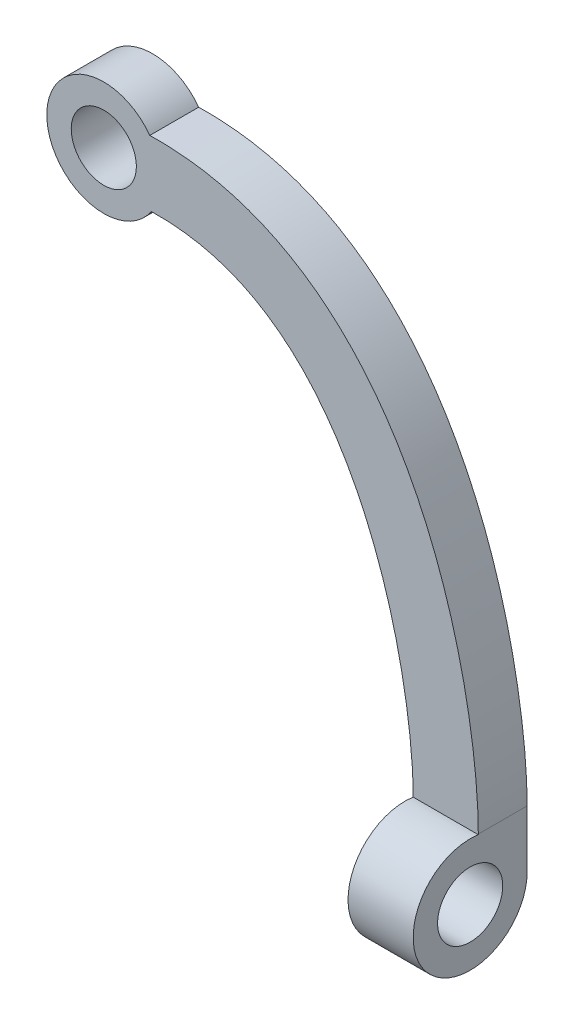
ISO-10303-21;
HEADER;
FILE_DESCRIPTION(('STEP AP214'),'2;1');
FILE_NAME('part.step','',(''),(''),'','','');
FILE_SCHEMA(('AUTOMOTIVE_DESIGN { 1 0 10303 214 1 1 1 1 }'));
ENDSEC;
DATA;
#1=APPLICATION_CONTEXT('core data for automotive mechanical design processes');
#2=APPLICATION_PROTOCOL_DEFINITION('international standard','automotive_design',2000,#1);
#3=PRODUCT_CONTEXT('',#1,'mechanical');
#4=PRODUCT('Part','Part','',(#3));
#5=PRODUCT_RELATED_PRODUCT_CATEGORY('part','',(#4));
#6=PRODUCT_DEFINITION_FORMATION('','',#4);
#7=PRODUCT_DEFINITION_CONTEXT('part definition',#1,'design');
#8=PRODUCT_DEFINITION('design','',#6,#7);
#9=PRODUCT_DEFINITION_SHAPE('','',#8);
#10=(LENGTH_UNIT() NAMED_UNIT(*) SI_UNIT(.MILLI.,.METRE.));
#11=(NAMED_UNIT(*) PLANE_ANGLE_UNIT() SI_UNIT($,.RADIAN.));
#12=(NAMED_UNIT(*) SI_UNIT($,.STERADIAN.) SOLID_ANGLE_UNIT());
#13=UNCERTAINTY_MEASURE_WITH_UNIT(LENGTH_MEASURE(1.E-05),#10,'distance_accuracy_value','');
#14=(GEOMETRIC_REPRESENTATION_CONTEXT(3) GLOBAL_UNCERTAINTY_ASSIGNED_CONTEXT((#13)) GLOBAL_UNIT_ASSIGNED_CONTEXT((#10,
#11,#12)) REPRESENTATION_CONTEXT('',''));
#15=CARTESIAN_POINT('',(0.,0.,0.));
#16=DIRECTION('',(0.,0.,1.));
#17=DIRECTION('',(1.,0.,0.));
#18=AXIS2_PLACEMENT_3D('',#15,#16,#17);
#19=CARTESIAN_POINT('',(38.0000011616749,6.99999999999998,14.));
#20=DIRECTION('',(1.,0.,0.));
#21=DIRECTION('',(0.,0.,-1.));
#22=AXIS2_PLACEMENT_3D('',#19,#20,#21);
#23=PLANE('',#22);
#24=CARTESIAN_POINT('',(38.0000011616749,0.,7.));
#25=DIRECTION('',(1.,0.,0.));
#26=DIRECTION('',(0.,0.,-1.));
#27=AXIS2_PLACEMENT_3D('',#24,#25,#26);
#28=CIRCLE('',#27,4.);
#29=CARTESIAN_POINT('',(38.0000011616749,0.,3.));
#30=VERTEX_POINT('',#29);
#31=EDGE_CURVE('E287',#30,#30,#28,.T.);
#32=ORIENTED_EDGE('',*,*,#31,.T.);
#33=EDGE_LOOP('',(#32));
#34=FACE_BOUND('',#33,.T.);
#35=CARTESIAN_POINT('',(38.0000011616749,0.,7.));
#36=DIRECTION('',(1.,0.,0.));
#37=DIRECTION('',(0.,0.,-1.));
#38=AXIS2_PLACEMENT_3D('',#35,#36,#37);
#39=CIRCLE('',#38,7.);
#40=CARTESIAN_POINT('',(38.0000011616749,6.92820323027553,5.99999999999999));
#41=VERTEX_POINT('',#40);
#42=CARTESIAN_POINT('',(38.0000011616749,0.,0.));
#43=VERTEX_POINT('',#42);
#44=EDGE_CURVE('E214',#41,#43,#39,.T.);
#45=ORIENTED_EDGE('',*,*,#44,.F.);
#46=DIRECTION('',(0.,-1.,0.));
#47=VECTOR('',#46,1.);
#48=CARTESIAN_POINT('',(38.0000011616749,6.99999999999999,5.99999999999999));
#49=LINE('',#48,#47);
#50=CARTESIAN_POINT('',(38.0000011616749,6.99999999999998,5.99999999999999));
#51=VERTEX_POINT('',#50);
#52=EDGE_CURVE('E185',#51,#41,#49,.T.);
#53=ORIENTED_EDGE('',*,*,#52,.F.);
#54=DIRECTION('',(0.,0.,-1.));
#55=VECTOR('',#54,1.);
#56=CARTESIAN_POINT('',(38.0000011616749,6.99999999999998,14.));
#57=LINE('',#56,#55);
#58=CARTESIAN_POINT('',(38.0000011616749,6.99999999999998,0.));
#59=VERTEX_POINT('',#58);
#60=EDGE_CURVE('E123',#51,#59,#57,.T.);
#61=ORIENTED_EDGE('',*,*,#60,.T.);
#62=DIRECTION('',(0.,-1.,0.));
#63=VECTOR('',#62,1.);
#64=CARTESIAN_POINT('',(38.0000011616749,6.99999999999998,0.));
#65=LINE('',#64,#63);
#66=EDGE_CURVE('E291',#59,#43,#65,.T.);
#67=ORIENTED_EDGE('',*,*,#66,.T.);
#68=EDGE_LOOP('',(#45,#53,#61,#67));
#69=FACE_BOUND('',#68,.T.);
#70=ADVANCED_FACE('F113',(#34,#69),#23,.F.);
#71=CARTESIAN_POINT('',(46.,-7.,14.));
#72=DIRECTION('',(-1.,0.,0.));
#73=DIRECTION('',(0.,0.,1.));
#74=AXIS2_PLACEMENT_3D('',#71,#72,#73);
#75=PLANE('',#74);
#76=CARTESIAN_POINT('',(46.,0.,7.));
#77=DIRECTION('',(1.,0.,0.));
#78=DIRECTION('',(0.,0.,-1.));
#79=AXIS2_PLACEMENT_3D('',#76,#77,#78);
#80=CIRCLE('',#79,4.);
#81=CARTESIAN_POINT('',(46.,0.,3.));
#82=VERTEX_POINT('',#81);
#83=EDGE_CURVE('E323',#82,#82,#80,.T.);
#84=ORIENTED_EDGE('',*,*,#83,.F.);
#85=EDGE_LOOP('',(#84));
#86=FACE_BOUND('',#85,.T.);
#87=CARTESIAN_POINT('',(46.,6.99568875913902,6.7543604566526));
#88=DIRECTION('',(0.,0.,1.));
#89=VECTOR('',#88,1.);
#90=LINE('',#87,#89);
#91=CARTESIAN_POINT('',(46.,6.99568875913902,6.7543604566526));
#92=VERTEX_POINT('',#91);
#93=CARTESIAN_POINT('',(46.,6.99568875913902,7.2456395433474));
#94=VERTEX_POINT('',#93);
#95=EDGE_CURVE('E192',#92,#94,#90,.T.);
#96=ORIENTED_EDGE('',*,*,#95,.T.);
#97=CARTESIAN_POINT('',(46.,0.,7.));
#98=DIRECTION('',(1.,0.,0.));
#99=DIRECTION('',(0.,0.,-1.));
#100=AXIS2_PLACEMENT_3D('',#97,#98,#99);
#101=CIRCLE('',#100,7.);
#102=CARTESIAN_POINT('',(46.,0.,0.));
#103=VERTEX_POINT('',#102);
#104=EDGE_CURVE('E217',#94,#103,#101,.T.);
#105=ORIENTED_EDGE('',*,*,#104,.T.);
#106=DIRECTION('',(0.,1.,0.));
#107=VECTOR('',#106,1.);
#108=CARTESIAN_POINT('',(46.,-7.,0.));
#109=LINE('',#108,#107);
#110=CARTESIAN_POINT('',(46.,6.99568875913902,0.));
#111=VERTEX_POINT('',#110);
#112=EDGE_CURVE('E296',#103,#111,#109,.T.);
#113=ORIENTED_EDGE('',*,*,#112,.T.);
#114=DIRECTION('',(0.,0.,-1.));
#115=VECTOR('',#114,1.);
#116=CARTESIAN_POINT('',(46.,6.99568875913902,14.));
#117=LINE('',#116,#115);
#118=CARTESIAN_POINT('',(46.,6.99568875913902,5.99999999999999));
#119=VERTEX_POINT('',#118);
#120=EDGE_CURVE('E199',#119,#111,#117,.T.);
#121=ORIENTED_EDGE('',*,*,#120,.F.);
#122=DIRECTION('',(0.,-1.,0.));
#123=VECTOR('',#122,1.);
#124=CARTESIAN_POINT('',(46.,0.,5.99999999999999));
#125=LINE('',#124,#123);
#126=CARTESIAN_POINT('',(46.,6.92820323027553,5.99999999999999));
#127=VERTEX_POINT('',#126);
#128=EDGE_CURVE('E182',#119,#127,#125,.T.);
#129=ORIENTED_EDGE('',*,*,#128,.T.);
#130=CARTESIAN_POINT('',(46.,0.,7.));
#131=DIRECTION('',(1.,0.,0.));
#132=DIRECTION('',(0.,0.,-1.));
#133=AXIS2_PLACEMENT_3D('',#130,#131,#132);
#134=CIRCLE('',#133,7.);
#135=EDGE_CURVE('E187',#127,#92,#134,.T.);
#136=ORIENTED_EDGE('',*,*,#135,.T.);
#137=EDGE_LOOP('',(#96,#105,#113,#121,#129,#136));
#138=FACE_BOUND('',#137,.T.);
#139=ADVANCED_FACE('F197',(#86,#138),#75,.F.);
#140=CARTESIAN_POINT('',(5.83577615778797,53.1342896336904,14.));
#141=CARTESIAN_POINT('',(6.23818864269357,53.1436239189996,14.));
#142=CARTESIAN_POINT('',(7.05227004115336,53.1461859423975,14.));
#143=CARTESIAN_POINT('',(8.60893046303791,53.0868432671362,14.));
#144=CARTESIAN_POINT('',(10.4740396141616,52.8975534908815,14.));
#145=CARTESIAN_POINT('',(12.5770681705305,52.4993244495572,14.));
#146=CARTESIAN_POINT('',(15.2207653392448,51.755589595783,14.));
#147=CARTESIAN_POINT('',(18.249448664361,50.4514150001244,14.));
#148=CARTESIAN_POINT('',(21.5152643238693,48.3428223146656,14.));
#149=CARTESIAN_POINT('',(24.4537903539413,45.7353354374777,14.));
#150=CARTESIAN_POINT('',(27.9570952326072,41.6672868153894,14.));
#151=CARTESIAN_POINT('',(31.5674227669321,35.6448354368556,14.));
#152=CARTESIAN_POINT('',(34.17925228785,28.9568019584791,14.));
#153=CARTESIAN_POINT('',(35.7182497675061,23.5955972147824,14.));
#154=CARTESIAN_POINT('',(36.6147837624453,19.6672816116272,14.));
#155=CARTESIAN_POINT('',(37.2722729412197,15.9303972863673,14.));
#156=CARTESIAN_POINT('',(37.6380985765587,13.0590677677107,14.));
#157=CARTESIAN_POINT('',(37.8325261304378,10.9600848249776,14.));
#158=CARTESIAN_POINT('',(37.9321887484044,9.49761119374754,14.));
#159=CARTESIAN_POINT('',(37.9793770763692,8.3879038733856,14.));
#160=CARTESIAN_POINT('',(37.997359238366,7.56534116428291,14.));
#161=CARTESIAN_POINT('',(38.0001044044445,7.1915787271414,14.));
#162=CARTESIAN_POINT('',(38.0000011616749,6.99999999999998,14.));
#163=B_SPLINE_CURVE_WITH_KNOTS('',3,(#140,#141,#142,#143,#144,#145,#146,#147,#148,#149,#150,
#151,#152,#153,#154,#155,#156,#157,#158,#159,#160,#161,#162),.UNSPECIFIED.,.F.,.F.,(4,1,1,1,1,1,
1,1,1,1,1,1,1,1,1,1,1,1,1,1,4),(0.,0.015625,0.03125,0.0625,0.09375,0.125,0.1875,0.25,0.3125,
0.375,0.5,0.625,0.6875,0.75,0.8125,0.875,0.90625,0.9375,0.96875,0.984375,1.),.UNSPECIFIED.);
#164=DIRECTION('',(0.,0.,-1.));
#165=VECTOR('',#164,1.);
#166=SURFACE_OF_LINEAR_EXTRUSION('',#163,#165);
#167=CARTESIAN_POINT('',(5.83577615778797,53.1342896336904,5.99999999999999));
#168=CARTESIAN_POINT('',(6.23818864269357,53.1436239189996,5.99999999999999));
#169=CARTESIAN_POINT('',(7.05227004115336,53.1461859423975,5.99999999999999));
#170=CARTESIAN_POINT('',(8.60893046303791,53.0868432671362,5.99999999999999));
#171=CARTESIAN_POINT('',(10.4740396141616,52.8975534908815,5.99999999999999));
#172=CARTESIAN_POINT('',(12.5770681705305,52.4993244495572,5.99999999999999));
#173=CARTESIAN_POINT('',(15.2207653392448,51.755589595783,5.99999999999999));
#174=CARTESIAN_POINT('',(18.249448664361,50.4514150001244,5.99999999999999));
#175=CARTESIAN_POINT('',(21.5152643238693,48.3428223146656,5.99999999999999));
#176=CARTESIAN_POINT('',(24.4537903539413,45.7353354374777,5.99999999999999));
#177=CARTESIAN_POINT('',(27.9570952326072,41.6672868153894,5.99999999999999));
#178=CARTESIAN_POINT('',(31.5674227669321,35.6448354368556,5.99999999999999));
#179=CARTESIAN_POINT('',(34.17925228785,28.9568019584791,5.99999999999999));
#180=CARTESIAN_POINT('',(35.7182497675061,23.5955972147824,5.99999999999999));
#181=CARTESIAN_POINT('',(36.6147837624453,19.6672816116272,5.99999999999999));
#182=CARTESIAN_POINT('',(37.2722729412197,15.9303972863673,5.99999999999999));
#183=CARTESIAN_POINT('',(37.6380985765587,13.0590677677107,5.99999999999999));
#184=CARTESIAN_POINT('',(37.8325261304378,10.9600848249776,5.99999999999999));
#185=CARTESIAN_POINT('',(37.9321887484044,9.49761119374754,5.99999999999999));
#186=CARTESIAN_POINT('',(37.9793770763692,8.3879038733856,5.99999999999999));
#187=CARTESIAN_POINT('',(37.997359238366,7.56534116428291,5.99999999999999));
#188=CARTESIAN_POINT('',(38.0001044044445,7.1915787271414,5.99999999999999));
#189=CARTESIAN_POINT('',(38.0000011616749,6.99999999999998,5.99999999999999));
#190=B_SPLINE_CURVE_WITH_KNOTS('',3,(#167,#168,#169,#170,#171,#172,#173,#174,#175,#176,#177,
#178,#179,#180,#181,#182,#183,#184,#185,#186,#187,#188,#189),.UNSPECIFIED.,.F.,.F.,(4,1,1,1,1,1,
1,1,1,1,1,1,1,1,1,1,1,1,1,1,4),(0.,0.015625,0.03125,0.0625,0.09375,0.125,0.1875,0.25,0.3125,
0.375,0.5,0.625,0.6875,0.75,0.8125,0.875,0.90625,0.9375,0.96875,0.984375,1.),.UNSPECIFIED.);
#191=CARTESIAN_POINT('',(5.83577615778797,53.1342896336904,6.));
#192=VERTEX_POINT('',#191);
#193=EDGE_CURVE('E312',#192,#51,#190,.T.);
#194=ORIENTED_EDGE('',*,*,#193,.F.);
#195=DIRECTION('',(0.,0.,-1.));
#196=VECTOR('',#195,1.);
#197=CARTESIAN_POINT('',(5.83577615778797,53.1342896336904,14.));
#198=LINE('',#197,#196);
#199=CARTESIAN_POINT('',(5.83577615778797,53.1342896336904,0.));
#200=VERTEX_POINT('',#199);
#201=EDGE_CURVE('E131',#192,#200,#198,.T.);
#202=ORIENTED_EDGE('',*,*,#201,.T.);
#203=CARTESIAN_POINT('',(5.83577615778797,53.1342896336904,0.));
#204=CARTESIAN_POINT('',(6.23818864269357,53.1436239189996,0.));
#205=CARTESIAN_POINT('',(7.05227004115336,53.1461859423975,0.));
#206=CARTESIAN_POINT('',(8.60893046303791,53.0868432671362,0.));
#207=CARTESIAN_POINT('',(10.4740396141616,52.8975534908815,0.));
#208=CARTESIAN_POINT('',(12.5770681705305,52.4993244495572,0.));
#209=CARTESIAN_POINT('',(15.2207653392448,51.755589595783,0.));
#210=CARTESIAN_POINT('',(18.249448664361,50.4514150001244,0.));
#211=CARTESIAN_POINT('',(21.5152643238693,48.3428223146656,0.));
#212=CARTESIAN_POINT('',(24.4537903539413,45.7353354374777,0.));
#213=CARTESIAN_POINT('',(27.9570952326072,41.6672868153894,0.));
#214=CARTESIAN_POINT('',(31.5674227669321,35.6448354368556,0.));
#215=CARTESIAN_POINT('',(34.17925228785,28.9568019584791,0.));
#216=CARTESIAN_POINT('',(35.7182497675061,23.5955972147824,0.));
#217=CARTESIAN_POINT('',(36.6147837624453,19.6672816116272,0.));
#218=CARTESIAN_POINT('',(37.2722729412197,15.9303972863673,0.));
#219=CARTESIAN_POINT('',(37.6380985765587,13.0590677677107,0.));
#220=CARTESIAN_POINT('',(37.8325261304378,10.9600848249776,0.));
#221=CARTESIAN_POINT('',(37.9321887484044,9.49761119374754,0.));
#222=CARTESIAN_POINT('',(37.9793770763692,8.3879038733856,0.));
#223=CARTESIAN_POINT('',(37.997359238366,7.56534116428291,0.));
#224=CARTESIAN_POINT('',(38.0001044044445,7.1915787271414,0.));
#225=CARTESIAN_POINT('',(38.0000011616749,6.99999999999998,0.));
#226=B_SPLINE_CURVE_WITH_KNOTS('',3,(#203,#204,#205,#206,#207,#208,#209,#210,#211,#212,#213,
#214,#215,#216,#217,#218,#219,#220,#221,#222,#223,#224,#225),.UNSPECIFIED.,.F.,.F.,(4,1,1,1,1,1,
1,1,1,1,1,1,1,1,1,1,1,1,1,1,4),(0.,0.015625,0.03125,0.0625,0.09375,0.125,0.1875,0.25,0.3125,
0.375,0.5,0.625,0.6875,0.75,0.8125,0.875,0.90625,0.9375,0.96875,0.984375,1.),.UNSPECIFIED.);
#227=EDGE_CURVE('E219',#200,#59,#226,.T.);
#228=ORIENTED_EDGE('',*,*,#227,.T.);
#229=ORIENTED_EDGE('',*,*,#60,.F.);
#230=EDGE_LOOP('',(#194,#202,#228,#229));
#231=FACE_BOUND('',#230,.T.);
#232=ADVANCED_FACE('F115',(#231),#166,.F.);
#233=CARTESIAN_POINT('',(46.,6.99568875913902,14.));
#234=CARTESIAN_POINT('',(46.0002560851669,7.47088397634541,14.));
#235=CARTESIAN_POINT('',(45.9863086592674,8.39165760234714,14.));
#236=CARTESIAN_POINT('',(45.9204507471029,9.94957599324083,14.));
#237=CARTESIAN_POINT('',(45.8071763002564,11.6053294020308,14.));
#238=CARTESIAN_POINT('',(45.5892179965686,13.957943212555,14.));
#239=CARTESIAN_POINT('',(45.1838800038941,17.1357586017828,14.));
#240=CARTESIAN_POINT('',(44.4595577452772,21.2523060143782,14.));
#241=CARTESIAN_POINT('',(43.4705356737301,25.5872864644797,14.));
#242=CARTESIAN_POINT('',(41.7606963939555,31.5454598087328,14.));
#243=CARTESIAN_POINT('',(38.8154686876858,39.1125410005638,14.));
#244=CARTESIAN_POINT('',(34.5585818988653,46.2608967312351,14.));
#245=CARTESIAN_POINT('',(30.192610770276,51.3435720811288,14.));
#246=CARTESIAN_POINT('',(26.3943446242828,54.7223646245647,14.));
#247=CARTESIAN_POINT('',(22.0402056158343,57.5393490469678,14.));
#248=CARTESIAN_POINT('',(17.1279305780924,59.6557906131729,14.));
#249=CARTESIAN_POINT('',(12.5788925477728,60.7276050825805,14.));
#250=CARTESIAN_POINT('',(8.71084810735461,61.1207898527353,14.));
#251=CARTESIAN_POINT('',(6.66065014688229,61.1555751514447,14.));
#252=CARTESIAN_POINT('',(5.65025954415288,61.1321383185597,14.));
#253=B_SPLINE_CURVE_WITH_KNOTS('',3,(#233,#234,#235,#236,#237,#238,#239,#240,#241,#242,#243,
#244,#245,#246,#247,#248,#249,#250,#251,#252),.UNSPECIFIED.,.F.,.F.,(4,1,1,1,1,1,1,1,1,1,1,1,1,
1,1,1,1,4),(0.,0.03125,0.0625,0.09375,0.125,0.1875,0.25,0.3125,0.375,0.5,0.625,0.6875,0.75,
0.8125,0.875,0.9375,0.96875,1.),.UNSPECIFIED.);
#254=DIRECTION('',(0.,0.,-1.));
#255=VECTOR('',#254,1.);
#256=SURFACE_OF_LINEAR_EXTRUSION('',#253,#255);
#257=CARTESIAN_POINT('',(46.,6.99568875913902,5.99999999999999));
#258=CARTESIAN_POINT('',(46.0002560851669,7.47088397634541,5.99999999999999));
#259=CARTESIAN_POINT('',(45.9863086592674,8.39165760234714,5.99999999999999));
#260=CARTESIAN_POINT('',(45.9204507471029,9.94957599324083,5.99999999999999));
#261=CARTESIAN_POINT('',(45.8071763002564,11.6053294020308,5.99999999999999));
#262=CARTESIAN_POINT('',(45.5892179965686,13.957943212555,5.99999999999999));
#263=CARTESIAN_POINT('',(45.1838800038941,17.1357586017828,5.99999999999999));
#264=CARTESIAN_POINT('',(44.4595577452772,21.2523060143782,5.99999999999999));
#265=CARTESIAN_POINT('',(43.4705356737301,25.5872864644797,5.99999999999999));
#266=CARTESIAN_POINT('',(41.7606963939555,31.5454598087328,5.99999999999999));
#267=CARTESIAN_POINT('',(38.8154686876858,39.1125410005638,5.99999999999999));
#268=CARTESIAN_POINT('',(34.5585818988653,46.2608967312351,5.99999999999999));
#269=CARTESIAN_POINT('',(30.192610770276,51.3435720811288,5.99999999999999));
#270=CARTESIAN_POINT('',(26.3943446242828,54.7223646245647,5.99999999999999));
#271=CARTESIAN_POINT('',(22.0402056158343,57.5393490469678,5.99999999999999));
#272=CARTESIAN_POINT('',(17.1279305780924,59.6557906131729,5.99999999999999));
#273=CARTESIAN_POINT('',(12.5788925477728,60.7276050825805,5.99999999999999));
#274=CARTESIAN_POINT('',(8.71084810735461,61.1207898527353,5.99999999999999));
#275=CARTESIAN_POINT('',(6.66065014688229,61.1555751514447,5.99999999999999));
#276=CARTESIAN_POINT('',(5.65025954415288,61.1321383185597,5.99999999999999));
#277=B_SPLINE_CURVE_WITH_KNOTS('',3,(#257,#258,#259,#260,#261,#262,#263,#264,#265,#266,#267,
#268,#269,#270,#271,#272,#273,#274,#275,#276),.UNSPECIFIED.,.F.,.F.,(4,1,1,1,1,1,1,1,1,1,1,1,1,
1,1,1,1,4),(0.,0.03125,0.0625,0.09375,0.125,0.1875,0.25,0.3125,0.375,0.5,0.625,0.6875,0.75,
0.8125,0.875,0.9375,0.96875,1.),.UNSPECIFIED.);
#278=CARTESIAN_POINT('',(5.65025954415288,61.1321383185597,6.));
#279=VERTEX_POINT('',#278);
#280=EDGE_CURVE('E203',#119,#279,#277,.T.);
#281=ORIENTED_EDGE('',*,*,#280,.F.);
#282=ORIENTED_EDGE('',*,*,#120,.T.);
#283=CARTESIAN_POINT('',(46.,6.99568875913902,0.));
#284=CARTESIAN_POINT('',(46.0002560851669,7.47088397634541,0.));
#285=CARTESIAN_POINT('',(45.9863086592674,8.39165760234714,0.));
#286=CARTESIAN_POINT('',(45.9204507471029,9.94957599324083,0.));
#287=CARTESIAN_POINT('',(45.8071763002564,11.6053294020308,0.));
#288=CARTESIAN_POINT('',(45.5892179965686,13.957943212555,0.));
#289=CARTESIAN_POINT('',(45.1838800038941,17.1357586017828,0.));
#290=CARTESIAN_POINT('',(44.4595577452772,21.2523060143782,0.));
#291=CARTESIAN_POINT('',(43.4705356737301,25.5872864644797,0.));
#292=CARTESIAN_POINT('',(41.7606963939555,31.5454598087328,0.));
#293=CARTESIAN_POINT('',(38.8154686876858,39.1125410005638,0.));
#294=CARTESIAN_POINT('',(34.5585818988653,46.2608967312351,0.));
#295=CARTESIAN_POINT('',(30.192610770276,51.3435720811288,0.));
#296=CARTESIAN_POINT('',(26.3943446242828,54.7223646245647,0.));
#297=CARTESIAN_POINT('',(22.0402056158343,57.5393490469678,0.));
#298=CARTESIAN_POINT('',(17.1279305780924,59.6557906131729,0.));
#299=CARTESIAN_POINT('',(12.5788925477728,60.7276050825805,0.));
#300=CARTESIAN_POINT('',(8.71084810735461,61.1207898527353,0.));
#301=CARTESIAN_POINT('',(6.66065014688229,61.1555751514447,0.));
#302=CARTESIAN_POINT('',(5.65025954415288,61.1321383185597,0.));
#303=B_SPLINE_CURVE_WITH_KNOTS('',3,(#283,#284,#285,#286,#287,#288,#289,#290,#291,#292,#293,
#294,#295,#296,#297,#298,#299,#300,#301,#302),.UNSPECIFIED.,.F.,.F.,(4,1,1,1,1,1,1,1,1,1,1,1,1,
1,1,1,1,4),(0.,0.03125,0.0625,0.09375,0.125,0.1875,0.25,0.3125,0.375,0.5,0.625,0.6875,0.75,
0.8125,0.875,0.9375,0.96875,1.),.UNSPECIFIED.);
#304=CARTESIAN_POINT('',(5.65025954415288,61.1321383185597,0.));
#305=VERTEX_POINT('',#304);
#306=EDGE_CURVE('E298',#111,#305,#303,.T.);
#307=ORIENTED_EDGE('',*,*,#306,.T.);
#308=DIRECTION('',(0.,0.,-1.));
#309=VECTOR('',#308,1.);
#310=CARTESIAN_POINT('',(5.65025954415288,61.1321383185597,14.));
#311=LINE('',#310,#309);
#312=EDGE_CURVE('E138',#279,#305,#311,.T.);
#313=ORIENTED_EDGE('',*,*,#312,.F.);
#314=EDGE_LOOP('',(#281,#282,#307,#313));
#315=FACE_BOUND('',#314,.T.);
#316=ADVANCED_FACE('F238',(#315),#256,.F.);
#317=CARTESIAN_POINT('',(0.,57.,14.));
#318=DIRECTION('',(0.,0.,-1.));
#319=DIRECTION('',(-1.,0.,0.));
#320=AXIS2_PLACEMENT_3D('',#317,#318,#319);
#321=CYLINDRICAL_SURFACE('',#320,7.);
#322=CARTESIAN_POINT('',(0.,57.,6.));
#323=DIRECTION('',(0.,0.,1.));
#324=DIRECTION('',(0.,-1.,0.));
#325=AXIS2_PLACEMENT_3D('',#322,#323,#324);
#326=CIRCLE('',#325,7.);
#327=EDGE_CURVE('E209',#279,#192,#326,.T.);
#328=ORIENTED_EDGE('',*,*,#327,.F.);
#329=ORIENTED_EDGE('',*,*,#312,.T.);
#330=CARTESIAN_POINT('',(0.,57.,0.));
#331=DIRECTION('',(0.,0.,1.));
#332=DIRECTION('',(1.,0.,0.));
#333=AXIS2_PLACEMENT_3D('',#330,#331,#332);
#334=CIRCLE('',#333,7.);
#335=EDGE_CURVE('E300',#305,#200,#334,.T.);
#336=ORIENTED_EDGE('',*,*,#335,.T.);
#337=ORIENTED_EDGE('',*,*,#201,.F.);
#338=EDGE_LOOP('',(#328,#329,#336,#337));
#339=FACE_BOUND('',#338,.T.);
#340=ADVANCED_FACE('F242',(#339),#321,.T.);
#341=CARTESIAN_POINT('',(0.,57.,14.));
#342=DIRECTION('',(0.,0.,-1.));
#343=DIRECTION('',(-1.,0.,0.));
#344=AXIS2_PLACEMENT_3D('',#341,#342,#343);
#345=CYLINDRICAL_SURFACE('',#344,4.);
#346=CARTESIAN_POINT('',(0.,57.,0.));
#347=DIRECTION('',(0.,0.,1.));
#348=DIRECTION('',(1.,0.,0.));
#349=AXIS2_PLACEMENT_3D('',#346,#347,#348);
#350=CIRCLE('',#349,4.);
#351=CARTESIAN_POINT('',(4.,57.,0.));
#352=VERTEX_POINT('',#351);
#353=EDGE_CURVE('E216',#352,#352,#350,.T.);
#354=ORIENTED_EDGE('',*,*,#353,.F.);
#355=EDGE_LOOP('',(#354));
#356=FACE_BOUND('',#355,.T.);
#357=CARTESIAN_POINT('',(0.,57.,6.));
#358=DIRECTION('',(0.,0.,1.));
#359=DIRECTION('',(0.,-1.,0.));
#360=AXIS2_PLACEMENT_3D('',#357,#358,#359);
#361=CIRCLE('',#360,4.);
#362=CARTESIAN_POINT('',(0.,53.,6.));
#363=VERTEX_POINT('',#362);
#364=EDGE_CURVE('E200',#363,#363,#361,.T.);
#365=ORIENTED_EDGE('',*,*,#364,.T.);
#366=EDGE_LOOP('',(#365));
#367=FACE_BOUND('',#366,.T.);
#368=ADVANCED_FACE('F272',(#356,#367),#345,.F.);
#369=CARTESIAN_POINT('',(31.3677231642507,35.511719016887,0.));
#370=DIRECTION('',(0.,0.,1.));
#371=DIRECTION('',(1.,0.,0.));
#372=AXIS2_PLACEMENT_3D('',#369,#370,#371);
#373=PLANE('',#372);
#374=ORIENTED_EDGE('',*,*,#353,.T.);
#375=EDGE_LOOP('',(#374));
#376=FACE_BOUND('',#375,.T.);
#377=DIRECTION('',(1.,0.,0.));
#378=VECTOR('',#377,1.);
#379=CARTESIAN_POINT('',(-7.,0.,0.));
#380=LINE('',#379,#378);
#381=EDGE_CURVE('E12',#43,#103,#380,.T.);
#382=ORIENTED_EDGE('',*,*,#381,.F.);
#383=ORIENTED_EDGE('',*,*,#66,.F.);
#384=ORIENTED_EDGE('',*,*,#227,.F.);
#385=ORIENTED_EDGE('',*,*,#335,.F.);
#386=ORIENTED_EDGE('',*,*,#306,.F.);
#387=ORIENTED_EDGE('',*,*,#112,.F.);
#388=EDGE_LOOP('',(#382,#383,#384,#385,#386,#387));
#389=FACE_BOUND('',#388,.T.);
#390=ADVANCED_FACE('F270',(#376,#389),#373,.F.);
#391=CARTESIAN_POINT('',(-7.,0.,7.));
#392=DIRECTION('',(1.,0.,0.));
#393=DIRECTION('',(0.,0.,-1.));
#394=AXIS2_PLACEMENT_3D('',#391,#392,#393);
#395=CYLINDRICAL_SURFACE('',#394,7.);
#396=ORIENTED_EDGE('',*,*,#44,.T.);
#397=ORIENTED_EDGE('',*,*,#381,.T.);
#398=ORIENTED_EDGE('',*,*,#104,.F.);
#399=ORIENTED_EDGE('',*,*,#95,.F.);
#400=ORIENTED_EDGE('',*,*,#135,.F.);
#401=DIRECTION('',(1.,0.,0.));
#402=VECTOR('',#401,1.);
#403=CARTESIAN_POINT('',(-7.,6.92820323027553,5.99999999999999));
#404=LINE('',#403,#402);
#405=EDGE_CURVE('E177',#41,#127,#404,.T.);
#406=ORIENTED_EDGE('',*,*,#405,.F.);
#407=EDGE_LOOP('',(#396,#397,#398,#399,#400,#406));
#408=FACE_BOUND('',#407,.T.);
#409=ADVANCED_FACE('F190',(#408),#395,.T.);
#410=CARTESIAN_POINT('',(-7.,0.,5.99999999999999));
#411=DIRECTION('',(0.,0.,1.));
#412=DIRECTION('',(0.,-1.,0.));
#413=AXIS2_PLACEMENT_3D('',#410,#411,#412);
#414=PLANE('',#413);
#415=ORIENTED_EDGE('',*,*,#364,.F.);
#416=EDGE_LOOP('',(#415));
#417=FACE_BOUND('',#416,.T.);
#418=ORIENTED_EDGE('',*,*,#52,.T.);
#419=ORIENTED_EDGE('',*,*,#405,.T.);
#420=ORIENTED_EDGE('',*,*,#128,.F.);
#421=ORIENTED_EDGE('',*,*,#280,.T.);
#422=ORIENTED_EDGE('',*,*,#327,.T.);
#423=ORIENTED_EDGE('',*,*,#193,.T.);
#424=EDGE_LOOP('',(#418,#419,#420,#421,#422,#423));
#425=FACE_BOUND('',#424,.T.);
#426=ADVANCED_FACE('F179',(#417,#425),#414,.T.);
#427=CARTESIAN_POINT('',(-7.,0.,7.));
#428=DIRECTION('',(1.,0.,0.));
#429=DIRECTION('',(0.,0.,-1.));
#430=AXIS2_PLACEMENT_3D('',#427,#428,#429);
#431=CYLINDRICAL_SURFACE('',#430,4.);
#432=ORIENTED_EDGE('',*,*,#83,.T.);
#433=EDGE_LOOP('',(#432));
#434=FACE_BOUND('',#433,.T.);
#435=ORIENTED_EDGE('',*,*,#31,.F.);
#436=EDGE_LOOP('',(#435));
#437=FACE_BOUND('',#436,.T.);
#438=ADVANCED_FACE('F328',(#434,#437),#431,.F.);
#439=CLOSED_SHELL('',(#70,#139,#232,#316,#340,#368,#390,#409,#426,#438));
#440=MANIFOLD_SOLID_BREP('B2',#439);
#441=ADVANCED_BREP_SHAPE_REPRESENTATION('',(#18,#440),#14);
#442=SHAPE_DEFINITION_REPRESENTATION(#9,#441);
ENDSEC;
END-ISO-10303-21;
